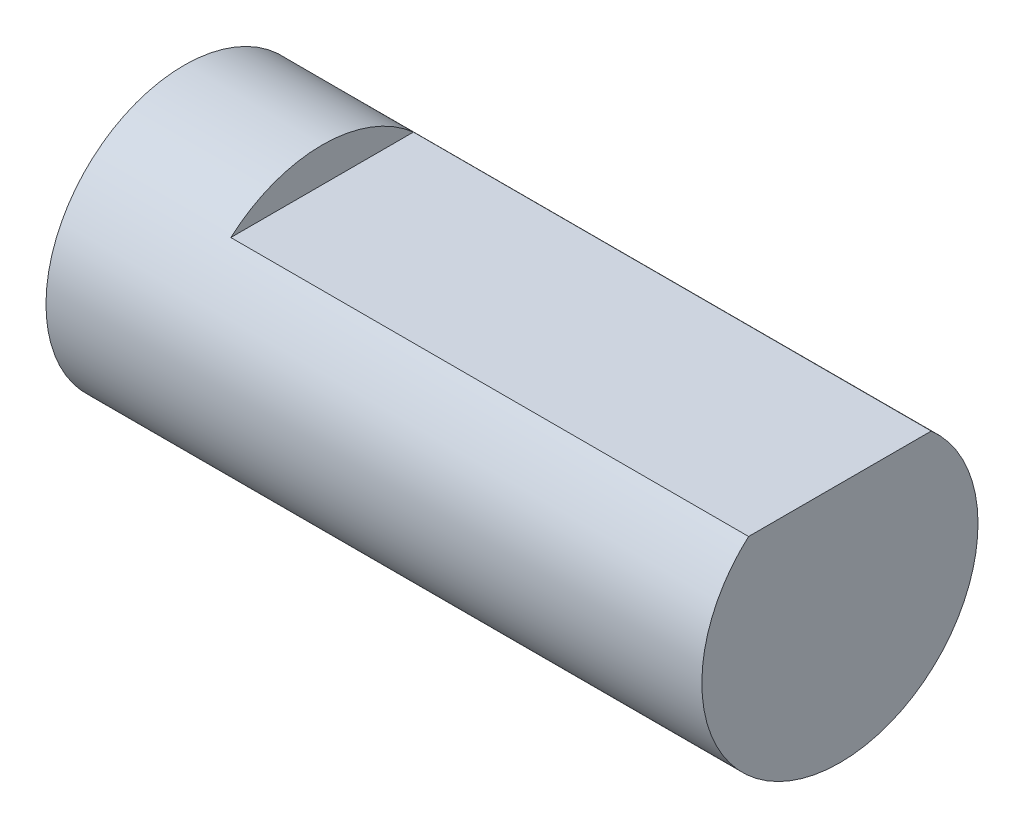
ISO-10303-21;
HEADER;
FILE_DESCRIPTION(('STEP AP214'),'2;1');
FILE_NAME('part.step','',(''),(''),'','','');
FILE_SCHEMA(('AUTOMOTIVE_DESIGN { 1 0 10303 214 1 1 1 1 }'));
ENDSEC;
DATA;
#1=APPLICATION_CONTEXT('core data for automotive mechanical design processes');
#2=APPLICATION_PROTOCOL_DEFINITION('international standard','automotive_design',2000,#1);
#3=PRODUCT_CONTEXT('',#1,'mechanical');
#4=PRODUCT('Part','Part','',(#3));
#5=PRODUCT_RELATED_PRODUCT_CATEGORY('part','',(#4));
#6=PRODUCT_DEFINITION_FORMATION('','',#4);
#7=PRODUCT_DEFINITION_CONTEXT('part definition',#1,'design');
#8=PRODUCT_DEFINITION('design','',#6,#7);
#9=PRODUCT_DEFINITION_SHAPE('','',#8);
#10=(LENGTH_UNIT() NAMED_UNIT(*) SI_UNIT(.MILLI.,.METRE.));
#11=(NAMED_UNIT(*) PLANE_ANGLE_UNIT() SI_UNIT($,.RADIAN.));
#12=(NAMED_UNIT(*) SI_UNIT($,.STERADIAN.) SOLID_ANGLE_UNIT());
#13=UNCERTAINTY_MEASURE_WITH_UNIT(LENGTH_MEASURE(1.E-05),#10,'distance_accuracy_value','');
#14=(GEOMETRIC_REPRESENTATION_CONTEXT(3) GLOBAL_UNCERTAINTY_ASSIGNED_CONTEXT((#13)) GLOBAL_UNIT_ASSIGNED_CONTEXT((#10,
#11,#12)) REPRESENTATION_CONTEXT('',''));
#15=CARTESIAN_POINT('',(0.,0.,0.));
#16=DIRECTION('',(0.,0.,1.));
#17=DIRECTION('',(1.,0.,0.));
#18=AXIS2_PLACEMENT_3D('',#15,#16,#17);
#19=CARTESIAN_POINT('',(19.,0.,0.));
#20=DIRECTION('',(-1.,0.,0.));
#21=DIRECTION('',(0.,0.,1.));
#22=AXIS2_PLACEMENT_3D('',#19,#20,#21);
#23=CYLINDRICAL_SURFACE('',#22,4.);
#24=CARTESIAN_POINT('',(19.,0.,0.));
#25=DIRECTION('',(1.,0.,0.));
#26=DIRECTION('',(0.,0.,-1.));
#27=AXIS2_PLACEMENT_3D('',#24,#25,#26);
#28=CIRCLE('',#27,4.);
#29=CARTESIAN_POINT('',(19.,3.,2.64575131106459));
#30=VERTEX_POINT('',#29);
#31=CARTESIAN_POINT('',(19.,3.,-2.64575131106459));
#32=VERTEX_POINT('',#31);
#33=EDGE_CURVE('E11',#30,#32,#28,.T.);
#34=ORIENTED_EDGE('',*,*,#33,.F.);
#35=DIRECTION('',(1.,0.,0.));
#36=VECTOR('',#35,1.);
#37=CARTESIAN_POINT('',(4.,3.,2.64575131106459));
#38=LINE('',#37,#36);
#39=CARTESIAN_POINT('',(4.,3.,2.64575131106459));
#40=VERTEX_POINT('',#39);
#41=EDGE_CURVE('E47',#40,#30,#38,.T.);
#42=ORIENTED_EDGE('',*,*,#41,.F.);
#43=CARTESIAN_POINT('',(4.,0.,0.));
#44=DIRECTION('',(1.,0.,0.));
#45=DIRECTION('',(0.,0.,-1.));
#46=AXIS2_PLACEMENT_3D('',#43,#44,#45);
#47=CIRCLE('',#46,4.);
#48=CARTESIAN_POINT('',(4.,3.,-2.64575131106459));
#49=VERTEX_POINT('',#48);
#50=EDGE_CURVE('E62',#49,#40,#47,.T.);
#51=ORIENTED_EDGE('',*,*,#50,.F.);
#52=DIRECTION('',(1.,0.,0.));
#53=VECTOR('',#52,1.);
#54=CARTESIAN_POINT('',(4.,3.,-2.64575131106459));
#55=LINE('',#54,#53);
#56=EDGE_CURVE('E53',#49,#32,#55,.T.);
#57=ORIENTED_EDGE('',*,*,#56,.T.);
#58=EDGE_LOOP('',(#34,#42,#51,#57));
#59=FACE_BOUND('',#58,.T.);
#60=CARTESIAN_POINT('',(0.,0.,0.));
#61=DIRECTION('',(1.,0.,0.));
#62=DIRECTION('',(0.,0.,-1.));
#63=AXIS2_PLACEMENT_3D('',#60,#61,#62);
#64=CIRCLE('',#63,4.);
#65=CARTESIAN_POINT('',(0.,0.,-4.));
#66=VERTEX_POINT('',#65);
#67=EDGE_CURVE('E36',#66,#66,#64,.T.);
#68=ORIENTED_EDGE('',*,*,#67,.T.);
#69=EDGE_LOOP('',(#68));
#70=FACE_BOUND('',#69,.T.);
#71=ADVANCED_FACE('F33',(#59,#70),#23,.T.);
#72=CARTESIAN_POINT('',(19.,0.,0.));
#73=DIRECTION('',(1.,0.,0.));
#74=DIRECTION('',(0.,0.,-1.));
#75=AXIS2_PLACEMENT_3D('',#72,#73,#74);
#76=PLANE('',#75);
#77=DIRECTION('',(0.,0.,-1.));
#78=VECTOR('',#77,1.);
#79=CARTESIAN_POINT('',(19.,3.,0.));
#80=LINE('',#79,#78);
#81=EDGE_CURVE('E58',#30,#32,#80,.T.);
#82=ORIENTED_EDGE('',*,*,#81,.F.);
#83=ORIENTED_EDGE('',*,*,#33,.T.);
#84=EDGE_LOOP('',(#82,#83));
#85=FACE_BOUND('',#84,.T.);
#86=ADVANCED_FACE('F68',(#85),#76,.T.);
#87=CARTESIAN_POINT('',(0.,0.,0.));
#88=DIRECTION('',(1.,0.,0.));
#89=DIRECTION('',(0.,0.,-1.));
#90=AXIS2_PLACEMENT_3D('',#87,#88,#89);
#91=PLANE('',#90);
#92=ORIENTED_EDGE('',*,*,#67,.F.);
#93=EDGE_LOOP('',(#92));
#94=FACE_BOUND('',#93,.T.);
#95=ADVANCED_FACE('F70',(#94),#91,.F.);
#96=CARTESIAN_POINT('',(4.,3.,0.));
#97=DIRECTION('',(0.,-1.,0.));
#98=DIRECTION('',(0.,0.,-1.));
#99=AXIS2_PLACEMENT_3D('',#96,#97,#98);
#100=PLANE('',#99);
#101=ORIENTED_EDGE('',*,*,#81,.T.);
#102=ORIENTED_EDGE('',*,*,#56,.F.);
#103=DIRECTION('',(0.,0.,-1.));
#104=VECTOR('',#103,1.);
#105=CARTESIAN_POINT('',(4.,3.,0.));
#106=LINE('',#105,#104);
#107=EDGE_CURVE('E85',#40,#49,#106,.T.);
#108=ORIENTED_EDGE('',*,*,#107,.F.);
#109=ORIENTED_EDGE('',*,*,#41,.T.);
#110=EDGE_LOOP('',(#101,#102,#108,#109));
#111=FACE_BOUND('',#110,.T.);
#112=ADVANCED_FACE('F59',(#111),#100,.F.);
#113=CARTESIAN_POINT('',(4.,0.,0.));
#114=DIRECTION('',(1.,0.,0.));
#115=DIRECTION('',(0.,0.,-1.));
#116=AXIS2_PLACEMENT_3D('',#113,#114,#115);
#117=PLANE('',#116);
#118=ORIENTED_EDGE('',*,*,#50,.T.);
#119=ORIENTED_EDGE('',*,*,#107,.T.);
#120=EDGE_LOOP('',(#118,#119));
#121=FACE_BOUND('',#120,.T.);
#122=ADVANCED_FACE('F80',(#121),#117,.T.);
#123=CLOSED_SHELL('',(#71,#86,#95,#112,#122));
#124=MANIFOLD_SOLID_BREP('B2',#123);
#125=ADVANCED_BREP_SHAPE_REPRESENTATION('',(#18,#124),#14);
#126=SHAPE_DEFINITION_REPRESENTATION(#9,#125);
ENDSEC;
END-ISO-10303-21;
